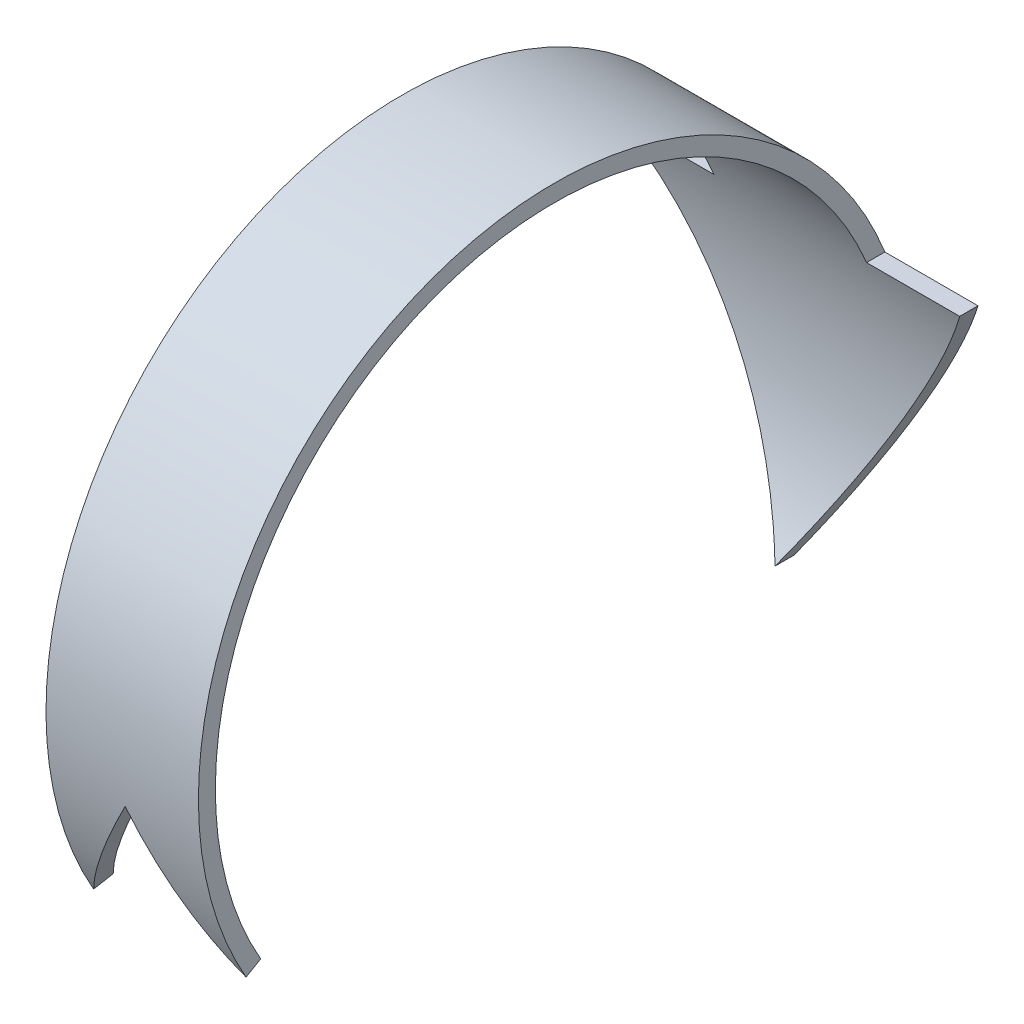
ISO-10303-21;
HEADER;
FILE_DESCRIPTION(('STEP AP214'),'2;1');
FILE_NAME('part.step','',(''),(''),'','','');
FILE_SCHEMA(('AUTOMOTIVE_DESIGN { 1 0 10303 214 1 1 1 1 }'));
ENDSEC;
DATA;
#1=APPLICATION_CONTEXT('core data for automotive mechanical design processes');
#2=APPLICATION_PROTOCOL_DEFINITION('international standard','automotive_design',2000,#1);
#3=PRODUCT_CONTEXT('',#1,'mechanical');
#4=PRODUCT('Part','Part','',(#3));
#5=PRODUCT_RELATED_PRODUCT_CATEGORY('part','',(#4));
#6=PRODUCT_DEFINITION_FORMATION('','',#4);
#7=PRODUCT_DEFINITION_CONTEXT('part definition',#1,'design');
#8=PRODUCT_DEFINITION('design','',#6,#7);
#9=PRODUCT_DEFINITION_SHAPE('','',#8);
#10=(LENGTH_UNIT() NAMED_UNIT(*) SI_UNIT(.MILLI.,.METRE.));
#11=(NAMED_UNIT(*) PLANE_ANGLE_UNIT() SI_UNIT($,.RADIAN.));
#12=(NAMED_UNIT(*) SI_UNIT($,.STERADIAN.) SOLID_ANGLE_UNIT());
#13=UNCERTAINTY_MEASURE_WITH_UNIT(LENGTH_MEASURE(1.E-05),#10,'distance_accuracy_value','');
#14=(GEOMETRIC_REPRESENTATION_CONTEXT(3) GLOBAL_UNCERTAINTY_ASSIGNED_CONTEXT((#13)) GLOBAL_UNIT_ASSIGNED_CONTEXT((#10,
#11,#12)) REPRESENTATION_CONTEXT('',''));
#15=CARTESIAN_POINT('',(0.,0.,0.));
#16=DIRECTION('',(0.,0.,1.));
#17=DIRECTION('',(1.,0.,0.));
#18=AXIS2_PLACEMENT_3D('',#15,#16,#17);
#19=CARTESIAN_POINT('',(-25.,-26.2500000000002,45.4663336986829));
#20=DIRECTION('',(0.,-0.866025403784436,-0.500000000000004));
#21=DIRECTION('',(1.,0.,0.));
#22=AXIS2_PLACEMENT_3D('',#19,#20,#21);
#23=PLANE('',#22);
#24=DIRECTION('',(0.277350098112615,-0.480384461415265,0.832050294337841));
#25=VECTOR('',#24,1.);
#26=CARTESIAN_POINT('',(8.46153846153845,-21.4202429404331,37.1009490832983));
#27=LINE('',#26,#25);
#28=CARTESIAN_POINT('',(10.528312163513,-25.0000000000002,43.3012701892218));
#29=VERTEX_POINT('',#28);
#30=CARTESIAN_POINT('',(11.25,-26.2500000000002,45.4663336986829));
#31=VERTEX_POINT('',#30);
#32=EDGE_CURVE('E12',#29,#31,#27,.T.);
#33=ORIENTED_EDGE('',*,*,#32,.F.);
#34=DIRECTION('',(-1.,0.,0.));
#35=VECTOR('',#34,1.);
#36=CARTESIAN_POINT('',(25.,-25.0000000000002,43.3012701892218));
#37=LINE('',#36,#35);
#38=CARTESIAN_POINT('',(11.25,-25.0000000000002,43.3012701892218));
#39=VERTEX_POINT('',#38);
#40=EDGE_CURVE('E135',#39,#29,#37,.T.);
#41=ORIENTED_EDGE('',*,*,#40,.F.);
#42=DIRECTION('',(0.,0.500000000000004,-0.866025403784436));
#43=VECTOR('',#42,1.);
#44=CARTESIAN_POINT('',(11.25,-26.2500000000002,45.4663336986829));
#45=LINE('',#44,#43);
#46=EDGE_CURVE('E112',#31,#39,#45,.T.);
#47=ORIENTED_EDGE('',*,*,#46,.F.);
#48=EDGE_LOOP('',(#33,#41,#47));
#49=FACE_BOUND('',#48,.T.);
#50=ADVANCED_FACE('F36',(#49),#23,.T.);
#51=CARTESIAN_POINT('',(0.,0.,0.));
#52=DIRECTION('',(-1.,0.,0.));
#53=DIRECTION('',(0.,0.,1.));
#54=AXIS2_PLACEMENT_3D('',#51,#52,#53);
#55=CYLINDRICAL_SURFACE('',#54,50.);
#56=CARTESIAN_POINT('',(3.90544456622771,0.,0.));
#57=DIRECTION('',(-0.86602540378444,0.499999999999998,0.));
#58=DIRECTION('',(-0.499999999999998,-0.86602540378444,0.));
#59=AXIS2_PLACEMENT_3D('',#56,#57,#58);
#60=ELLIPSE('',#59,57.7350269189625,50.);
#61=CARTESIAN_POINT('',(-10.528312163513,-25.0000000000002,43.3012701892218));
#62=VERTEX_POINT('',#61);
#63=CARTESIAN_POINT('',(0.,-6.76442841485023,49.5403119511814));
#64=VERTEX_POINT('',#63);
#65=EDGE_CURVE('E143',#62,#64,#60,.T.);
#66=ORIENTED_EDGE('',*,*,#65,.F.);
#67=CARTESIAN_POINT('',(-11.25,-25.0000000000002,43.3012701892218));
#68=VERTEX_POINT('',#67);
#69=EDGE_CURVE('E173',#62,#68,#37,.T.);
#70=ORIENTED_EDGE('',*,*,#69,.T.);
#71=CARTESIAN_POINT('',(-11.25,0.,0.));
#72=DIRECTION('',(-1.,0.,0.));
#73=DIRECTION('',(0.,0.,1.));
#74=AXIS2_PLACEMENT_3D('',#71,#72,#73);
#75=CIRCLE('',#74,50.);
#76=CARTESIAN_POINT('',(-11.25,19.301270189222,-46.124407520126));
#77=VERTEX_POINT('',#76);
#78=EDGE_CURVE('E170',#68,#77,#75,.T.);
#79=ORIENTED_EDGE('',*,*,#78,.T.);
#80=DIRECTION('',(-1.,0.,0.));
#81=VECTOR('',#80,1.);
#82=CARTESIAN_POINT('',(0.,19.301270189222,-46.124407520126));
#83=LINE('',#82,#81);
#84=CARTESIAN_POINT('',(-25.,19.301270189222,-46.124407520126));
#85=VERTEX_POINT('',#84);
#86=EDGE_CURVE('E146',#77,#85,#83,.T.);
#87=ORIENTED_EDGE('',*,*,#86,.T.);
#88=CARTESIAN_POINT('',(-13.8564064605511,0.,0.));
#89=DIRECTION('',(-0.86602540378444,-0.499999999999998,0.));
#90=DIRECTION('',(-0.499999999999998,0.86602540378444,0.));
#91=AXIS2_PLACEMENT_3D('',#88,#89,#90);
#92=ELLIPSE('',#91,57.7350269189625,50.);
#93=CARTESIAN_POINT('',(0.,-24.0000000000002,-43.8634243989225));
#94=VERTEX_POINT('',#93);
#95=EDGE_CURVE('E159',#85,#94,#92,.T.);
#96=ORIENTED_EDGE('',*,*,#95,.T.);
#97=CARTESIAN_POINT('',(13.8564064605511,0.,0.));
#98=DIRECTION('',(0.86602540378444,-0.499999999999998,0.));
#99=DIRECTION('',(-0.499999999999998,-0.86602540378444,0.));
#100=AXIS2_PLACEMENT_3D('',#97,#98,#99);
#101=ELLIPSE('',#100,57.7350269189625,50.);
#102=CARTESIAN_POINT('',(25.,19.301270189222,-46.1244075201259));
#103=VERTEX_POINT('',#102);
#104=EDGE_CURVE('E162',#94,#103,#101,.T.);
#105=ORIENTED_EDGE('',*,*,#104,.T.);
#106=DIRECTION('',(-1.,0.,0.));
#107=VECTOR('',#106,1.);
#108=CARTESIAN_POINT('',(0.,19.301270189222,-46.1244075201259));
#109=LINE('',#108,#107);
#110=CARTESIAN_POINT('',(11.25,19.301270189222,-46.1244075201259));
#111=VERTEX_POINT('',#110);
#112=EDGE_CURVE('E165',#103,#111,#109,.T.);
#113=ORIENTED_EDGE('',*,*,#112,.T.);
#114=CARTESIAN_POINT('',(11.25,0.,0.));
#115=DIRECTION('',(1.,0.,0.));
#116=DIRECTION('',(0.,0.,-1.));
#117=AXIS2_PLACEMENT_3D('',#114,#115,#116);
#118=CIRCLE('',#117,50.);
#119=EDGE_CURVE('E168',#111,#39,#118,.T.);
#120=ORIENTED_EDGE('',*,*,#119,.T.);
#121=ORIENTED_EDGE('',*,*,#40,.T.);
#122=CARTESIAN_POINT('',(-3.90544456622771,0.,0.));
#123=DIRECTION('',(0.86602540378444,0.499999999999998,0.));
#124=DIRECTION('',(-0.499999999999998,0.86602540378444,0.));
#125=AXIS2_PLACEMENT_3D('',#122,#123,#124);
#126=ELLIPSE('',#125,57.7350269189625,50.);
#127=EDGE_CURVE('E127',#64,#29,#126,.T.);
#128=ORIENTED_EDGE('',*,*,#127,.F.);
#129=EDGE_LOOP('',(#66,#70,#79,#87,#96,#105,#113,#120,#121,#128));
#130=FACE_BOUND('',#129,.T.);
#131=ADVANCED_FACE('F38',(#130),#55,.F.);
#132=CARTESIAN_POINT('',(0.,0.,0.));
#133=DIRECTION('',(-1.,0.,0.));
#134=DIRECTION('',(0.,0.,1.));
#135=AXIS2_PLACEMENT_3D('',#132,#133,#134);
#136=CYLINDRICAL_SURFACE('',#135,52.5);
#137=CARTESIAN_POINT('',(-3.90544456622771,0.,0.));
#138=DIRECTION('',(0.86602540378444,0.499999999999998,0.));
#139=DIRECTION('',(-0.499999999999998,0.86602540378444,0.));
#140=AXIS2_PLACEMENT_3D('',#137,#138,#139);
#141=ELLIPSE('',#140,60.6217782649106,52.5);
#142=CARTESIAN_POINT('',(0.,-6.76442841485023,52.0623905350145));
#143=VERTEX_POINT('',#142);
#144=EDGE_CURVE('E124',#31,#143,#141,.F.);
#145=ORIENTED_EDGE('',*,*,#144,.F.);
#146=CARTESIAN_POINT('',(11.25,0.,0.));
#147=DIRECTION('',(1.,0.,0.));
#148=DIRECTION('',(0.,0.,-1.));
#149=AXIS2_PLACEMENT_3D('',#146,#147,#148);
#150=CIRCLE('',#149,52.5);
#151=CARTESIAN_POINT('',(11.25,19.301270189222,-48.8232625813008));
#152=VERTEX_POINT('',#151);
#153=EDGE_CURVE('E109',#31,#152,#150,.F.);
#154=ORIENTED_EDGE('',*,*,#153,.T.);
#155=DIRECTION('',(-1.,0.,0.));
#156=VECTOR('',#155,1.);
#157=CARTESIAN_POINT('',(0.,19.301270189222,-48.8232625813008));
#158=LINE('',#157,#156);
#159=CARTESIAN_POINT('',(25.,19.301270189222,-48.8232625813009));
#160=VERTEX_POINT('',#159);
#161=EDGE_CURVE('E118',#152,#160,#158,.F.);
#162=ORIENTED_EDGE('',*,*,#161,.T.);
#163=CARTESIAN_POINT('',(13.8564064605511,0.,0.));
#164=DIRECTION('',(0.86602540378444,-0.499999999999998,0.));
#165=DIRECTION('',(-0.499999999999998,-0.86602540378444,0.));
#166=AXIS2_PLACEMENT_3D('',#163,#164,#165);
#167=ELLIPSE('',#166,60.6217782649106,52.5);
#168=CARTESIAN_POINT('',(0.,-24.0000000000002,-46.69314724882));
#169=VERTEX_POINT('',#168);
#170=EDGE_CURVE('E181',#160,#169,#167,.F.);
#171=ORIENTED_EDGE('',*,*,#170,.T.);
#172=CARTESIAN_POINT('',(-13.8564064605511,0.,0.));
#173=DIRECTION('',(-0.86602540378444,-0.499999999999998,0.));
#174=DIRECTION('',(-0.499999999999998,0.86602540378444,0.));
#175=AXIS2_PLACEMENT_3D('',#172,#173,#174);
#176=ELLIPSE('',#175,60.6217782649106,52.5);
#177=CARTESIAN_POINT('',(-25.,19.301270189222,-48.8232625813008));
#178=VERTEX_POINT('',#177);
#179=EDGE_CURVE('E178',#169,#178,#176,.F.);
#180=ORIENTED_EDGE('',*,*,#179,.T.);
#181=DIRECTION('',(-1.,0.,0.));
#182=VECTOR('',#181,1.);
#183=CARTESIAN_POINT('',(0.,19.301270189222,-48.8232625813008));
#184=LINE('',#183,#182);
#185=CARTESIAN_POINT('',(-11.25,19.301270189222,-48.8232625813008));
#186=VERTEX_POINT('',#185);
#187=EDGE_CURVE('E176',#178,#186,#184,.F.);
#188=ORIENTED_EDGE('',*,*,#187,.T.);
#189=CARTESIAN_POINT('',(-11.25,0.,0.));
#190=DIRECTION('',(-1.,0.,0.));
#191=DIRECTION('',(0.,0.,1.));
#192=AXIS2_PLACEMENT_3D('',#189,#190,#191);
#193=CIRCLE('',#192,52.5);
#194=CARTESIAN_POINT('',(-11.25,-26.2500000000002,45.4663336986829));
#195=VERTEX_POINT('',#194);
#196=EDGE_CURVE('E51',#186,#195,#193,.F.);
#197=ORIENTED_EDGE('',*,*,#196,.T.);
#198=CARTESIAN_POINT('',(3.90544456622771,0.,0.));
#199=DIRECTION('',(-0.86602540378444,0.499999999999998,0.));
#200=DIRECTION('',(-0.499999999999998,-0.86602540378444,0.));
#201=AXIS2_PLACEMENT_3D('',#198,#199,#200);
#202=ELLIPSE('',#201,60.6217782649106,52.5);
#203=EDGE_CURVE('E132',#143,#195,#202,.F.);
#204=ORIENTED_EDGE('',*,*,#203,.F.);
#205=EDGE_LOOP('',(#145,#154,#162,#171,#180,#188,#197,#204));
#206=FACE_BOUND('',#205,.T.);
#207=ADVANCED_FACE('F130',(#206),#136,.T.);
#208=DIRECTION('',(0.277350098112615,0.480384461415265,-0.832050294337841));
#209=VECTOR('',#208,1.);
#210=CARTESIAN_POINT('',(-12.3076923076923,-28.0819768156981,48.6394106217598));
#211=LINE('',#210,#209);
#212=EDGE_CURVE('E44',#195,#62,#211,.T.);
#213=ORIENTED_EDGE('',*,*,#212,.F.);
#214=DIRECTION('',(0.,-0.500000000000004,0.866025403784436));
#215=VECTOR('',#214,1.);
#216=CARTESIAN_POINT('',(-11.25,-26.2500000000002,45.4663336986829));
#217=LINE('',#216,#215);
#218=EDGE_CURVE('E133',#68,#195,#217,.T.);
#219=ORIENTED_EDGE('',*,*,#218,.F.);
#220=ORIENTED_EDGE('',*,*,#69,.F.);
#221=EDGE_LOOP('',(#213,#219,#220));
#222=FACE_BOUND('',#221,.T.);
#223=ADVANCED_FACE('F193',(#222),#23,.T.);
#224=CARTESIAN_POINT('',(-11.25,19.301270189222,-52.5));
#225=DIRECTION('',(-1.,0.,0.));
#226=DIRECTION('',(0.,0.,1.));
#227=AXIS2_PLACEMENT_3D('',#224,#225,#226);
#228=PLANE('',#227);
#229=ORIENTED_EDGE('',*,*,#78,.F.);
#230=ORIENTED_EDGE('',*,*,#218,.T.);
#231=ORIENTED_EDGE('',*,*,#196,.F.);
#232=DIRECTION('',(0.,0.,1.));
#233=VECTOR('',#232,1.);
#234=CARTESIAN_POINT('',(-11.25,19.301270189222,-52.5));
#235=LINE('',#234,#233);
#236=EDGE_CURVE('E59',#186,#77,#235,.T.);
#237=ORIENTED_EDGE('',*,*,#236,.T.);
#238=EDGE_LOOP('',(#229,#230,#231,#237));
#239=FACE_BOUND('',#238,.T.);
#240=ADVANCED_FACE('F195',(#239),#228,.T.);
#241=CARTESIAN_POINT('',(11.25,52.5,-52.5));
#242=DIRECTION('',(1.,0.,0.));
#243=DIRECTION('',(0.,0.,-1.));
#244=AXIS2_PLACEMENT_3D('',#241,#242,#243);
#245=PLANE('',#244);
#246=DIRECTION('',(0.,0.,1.));
#247=VECTOR('',#246,1.);
#248=CARTESIAN_POINT('',(11.25,19.301270189222,-52.5));
#249=LINE('',#248,#247);
#250=EDGE_CURVE('E115',#152,#111,#249,.T.);
#251=ORIENTED_EDGE('',*,*,#250,.F.);
#252=ORIENTED_EDGE('',*,*,#153,.F.);
#253=ORIENTED_EDGE('',*,*,#46,.T.);
#254=ORIENTED_EDGE('',*,*,#119,.F.);
#255=EDGE_LOOP('',(#251,#252,#253,#254));
#256=FACE_BOUND('',#255,.T.);
#257=ADVANCED_FACE('F110',(#256),#245,.T.);
#258=CARTESIAN_POINT('',(11.25,19.301270189222,-52.5));
#259=DIRECTION('',(0.,1.,0.));
#260=DIRECTION('',(-1.,0.,0.));
#261=AXIS2_PLACEMENT_3D('',#258,#259,#260);
#262=PLANE('',#261);
#263=DIRECTION('',(0.,0.,1.));
#264=VECTOR('',#263,1.);
#265=CARTESIAN_POINT('',(25.,19.301270189222,-52.5));
#266=LINE('',#265,#264);
#267=EDGE_CURVE('E147',#160,#103,#266,.T.);
#268=ORIENTED_EDGE('',*,*,#267,.F.);
#269=ORIENTED_EDGE('',*,*,#161,.F.);
#270=ORIENTED_EDGE('',*,*,#250,.T.);
#271=ORIENTED_EDGE('',*,*,#112,.F.);
#272=EDGE_LOOP('',(#268,#269,#270,#271));
#273=FACE_BOUND('',#272,.T.);
#274=ADVANCED_FACE('F205',(#273),#262,.T.);
#275=CARTESIAN_POINT('',(25.,19.301270189222,-52.5));
#276=DIRECTION('',(0.86602540378444,-0.499999999999998,0.));
#277=DIRECTION('',(0.499999999999998,0.86602540378444,0.));
#278=AXIS2_PLACEMENT_3D('',#275,#276,#277);
#279=PLANE('',#278);
#280=DIRECTION('',(0.,0.,1.));
#281=VECTOR('',#280,1.);
#282=CARTESIAN_POINT('',(0.,-24.0000000000002,-52.5));
#283=LINE('',#282,#281);
#284=EDGE_CURVE('E150',#169,#94,#283,.T.);
#285=ORIENTED_EDGE('',*,*,#284,.F.);
#286=ORIENTED_EDGE('',*,*,#170,.F.);
#287=ORIENTED_EDGE('',*,*,#267,.T.);
#288=ORIENTED_EDGE('',*,*,#104,.F.);
#289=EDGE_LOOP('',(#285,#286,#287,#288));
#290=FACE_BOUND('',#289,.T.);
#291=ADVANCED_FACE('F203',(#290),#279,.T.);
#292=CARTESIAN_POINT('',(0.,-24.0000000000002,-52.5));
#293=DIRECTION('',(-0.86602540378444,-0.499999999999998,0.));
#294=DIRECTION('',(0.499999999999998,-0.86602540378444,0.));
#295=AXIS2_PLACEMENT_3D('',#292,#293,#294);
#296=PLANE('',#295);
#297=DIRECTION('',(0.,0.,1.));
#298=VECTOR('',#297,1.);
#299=CARTESIAN_POINT('',(-25.,19.301270189222,-52.5));
#300=LINE('',#299,#298);
#301=EDGE_CURVE('E153',#178,#85,#300,.T.);
#302=ORIENTED_EDGE('',*,*,#301,.F.);
#303=ORIENTED_EDGE('',*,*,#179,.F.);
#304=ORIENTED_EDGE('',*,*,#284,.T.);
#305=ORIENTED_EDGE('',*,*,#95,.F.);
#306=EDGE_LOOP('',(#302,#303,#304,#305));
#307=FACE_BOUND('',#306,.T.);
#308=ADVANCED_FACE('F199',(#307),#296,.T.);
#309=CARTESIAN_POINT('',(-25.,19.301270189222,-52.5));
#310=DIRECTION('',(0.,1.,0.));
#311=DIRECTION('',(0.,0.,1.));
#312=AXIS2_PLACEMENT_3D('',#309,#310,#311);
#313=PLANE('',#312);
#314=ORIENTED_EDGE('',*,*,#236,.F.);
#315=ORIENTED_EDGE('',*,*,#187,.F.);
#316=ORIENTED_EDGE('',*,*,#301,.T.);
#317=ORIENTED_EDGE('',*,*,#86,.F.);
#318=EDGE_LOOP('',(#314,#315,#316,#317));
#319=FACE_BOUND('',#318,.T.);
#320=ADVANCED_FACE('F196',(#319),#313,.T.);
#321=CARTESIAN_POINT('',(0.,-6.76442841485023,52.5));
#322=DIRECTION('',(-0.86602540378444,0.499999999999998,0.));
#323=DIRECTION('',(-0.499999999999998,-0.86602540378444,0.));
#324=AXIS2_PLACEMENT_3D('',#321,#322,#323);
#325=PLANE('',#324);
#326=ORIENTED_EDGE('',*,*,#65,.T.);
#327=DIRECTION('',(0.,0.,-1.));
#328=VECTOR('',#327,1.);
#329=CARTESIAN_POINT('',(0.,-6.76442841485023,52.5));
#330=LINE('',#329,#328);
#331=EDGE_CURVE('E136',#143,#64,#330,.T.);
#332=ORIENTED_EDGE('',*,*,#331,.F.);
#333=ORIENTED_EDGE('',*,*,#203,.T.);
#334=ORIENTED_EDGE('',*,*,#212,.T.);
#335=EDGE_LOOP('',(#326,#332,#333,#334));
#336=FACE_BOUND('',#335,.T.);
#337=ADVANCED_FACE('F188',(#336),#325,.F.);
#338=CARTESIAN_POINT('',(0.,-6.76442841485023,52.5));
#339=DIRECTION('',(0.86602540378444,0.499999999999998,0.));
#340=DIRECTION('',(-0.499999999999998,0.86602540378444,0.));
#341=AXIS2_PLACEMENT_3D('',#338,#339,#340);
#342=PLANE('',#341);
#343=ORIENTED_EDGE('',*,*,#127,.T.);
#344=ORIENTED_EDGE('',*,*,#32,.T.);
#345=ORIENTED_EDGE('',*,*,#144,.T.);
#346=ORIENTED_EDGE('',*,*,#331,.T.);
#347=EDGE_LOOP('',(#343,#344,#345,#346));
#348=FACE_BOUND('',#347,.T.);
#349=ADVANCED_FACE('F122',(#348),#342,.F.);
#350=CLOSED_SHELL('',(#50,#131,#207,#223,#240,#257,#274,#291,#308,#320,#337,#349));
#351=MANIFOLD_SOLID_BREP('B2',#350);
#352=ADVANCED_BREP_SHAPE_REPRESENTATION('',(#18,#351),#14);
#353=SHAPE_DEFINITION_REPRESENTATION(#9,#352);
ENDSEC;
END-ISO-10303-21;
